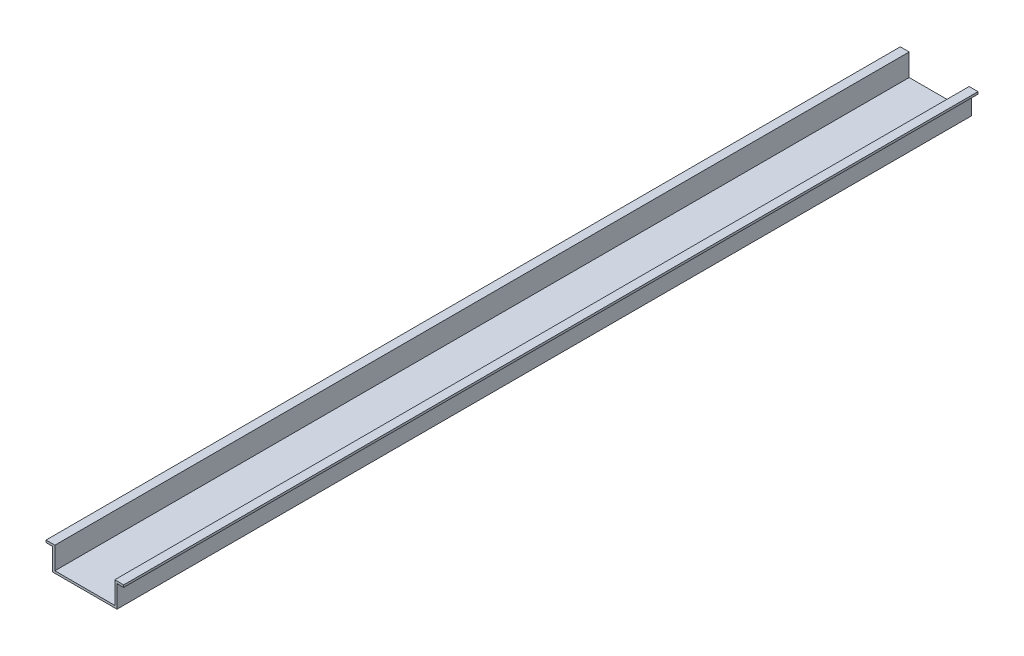
ISO-10303-21;
HEADER;
FILE_DESCRIPTION(('STEP AP214'),'2;1');
FILE_NAME('part.step','',(''),(''),'','','');
FILE_SCHEMA(('AUTOMOTIVE_DESIGN { 1 0 10303 214 1 1 1 1 }'));
ENDSEC;
DATA;
#1=APPLICATION_CONTEXT('core data for automotive mechanical design processes');
#2=APPLICATION_PROTOCOL_DEFINITION('international standard','automotive_design',2000,#1);
#3=PRODUCT_CONTEXT('',#1,'mechanical');
#4=PRODUCT('Part','Part','',(#3));
#5=PRODUCT_RELATED_PRODUCT_CATEGORY('part','',(#4));
#6=PRODUCT_DEFINITION_FORMATION('','',#4);
#7=PRODUCT_DEFINITION_CONTEXT('part definition',#1,'design');
#8=PRODUCT_DEFINITION('design','',#6,#7);
#9=PRODUCT_DEFINITION_SHAPE('','',#8);
#10=(LENGTH_UNIT() NAMED_UNIT(*) SI_UNIT(.MILLI.,.METRE.));
#11=(NAMED_UNIT(*) PLANE_ANGLE_UNIT() SI_UNIT($,.RADIAN.));
#12=(NAMED_UNIT(*) SI_UNIT($,.STERADIAN.) SOLID_ANGLE_UNIT());
#13=UNCERTAINTY_MEASURE_WITH_UNIT(LENGTH_MEASURE(1.E-05),#10,'distance_accuracy_value','');
#14=(GEOMETRIC_REPRESENTATION_CONTEXT(3) GLOBAL_UNCERTAINTY_ASSIGNED_CONTEXT((#13)) GLOBAL_UNIT_ASSIGNED_CONTEXT((#10,
#11,#12)) REPRESENTATION_CONTEXT('',''));
#15=CARTESIAN_POINT('',(0.,0.,0.));
#16=DIRECTION('',(0.,0.,1.));
#17=DIRECTION('',(1.,0.,0.));
#18=AXIS2_PLACEMENT_3D('',#15,#16,#17);
#19=CARTESIAN_POINT('',(-17.5,10.,385.));
#20=DIRECTION('',(1.,0.,0.));
#21=DIRECTION('',(0.,0.,-1.));
#22=AXIS2_PLACEMENT_3D('',#19,#20,#21);
#23=PLANE('',#22);
#24=DIRECTION('',(0.,-1.,0.));
#25=VECTOR('',#24,1.);
#26=CARTESIAN_POINT('',(-17.5,10.,0.));
#27=LINE('',#26,#25);
#28=CARTESIAN_POINT('',(-17.5,10.,0.));
#29=VERTEX_POINT('',#28);
#30=CARTESIAN_POINT('',(-17.5,9.,0.));
#31=VERTEX_POINT('',#30);
#32=EDGE_CURVE('E164',#29,#31,#27,.T.);
#33=ORIENTED_EDGE('',*,*,#32,.T.);
#34=DIRECTION('',(0.,0.,-1.));
#35=VECTOR('',#34,1.);
#36=CARTESIAN_POINT('',(-17.5,9.,385.));
#37=LINE('',#36,#35);
#38=CARTESIAN_POINT('',(-17.5,9.,385.));
#39=VERTEX_POINT('',#38);
#40=EDGE_CURVE('E11',#39,#31,#37,.T.);
#41=ORIENTED_EDGE('',*,*,#40,.F.);
#42=DIRECTION('',(0.,-1.,0.));
#43=VECTOR('',#42,1.);
#44=CARTESIAN_POINT('',(-17.5,10.,385.));
#45=LINE('',#44,#43);
#46=CARTESIAN_POINT('',(-17.5,10.,385.));
#47=VERTEX_POINT('',#46);
#48=EDGE_CURVE('E198',#47,#39,#45,.T.);
#49=ORIENTED_EDGE('',*,*,#48,.F.);
#50=DIRECTION('',(0.,0.,-1.));
#51=VECTOR('',#50,1.);
#52=CARTESIAN_POINT('',(-17.5,10.,385.));
#53=LINE('',#52,#51);
#54=EDGE_CURVE('E160',#47,#29,#53,.T.);
#55=ORIENTED_EDGE('',*,*,#54,.T.);
#56=EDGE_LOOP('',(#33,#41,#49,#55));
#57=FACE_BOUND('',#56,.T.);
#58=ADVANCED_FACE('F39',(#57),#23,.F.);
#59=CARTESIAN_POINT('',(-17.5,9.,385.));
#60=DIRECTION('',(0.,1.,0.));
#61=DIRECTION('',(0.,0.,1.));
#62=AXIS2_PLACEMENT_3D('',#59,#60,#61);
#63=PLANE('',#62);
#64=DIRECTION('',(1.,0.,0.));
#65=VECTOR('',#64,1.);
#66=CARTESIAN_POINT('',(-17.5,9.,0.));
#67=LINE('',#66,#65);
#68=CARTESIAN_POINT('',(-14.5,9.,0.));
#69=VERTEX_POINT('',#68);
#70=EDGE_CURVE('E168',#31,#69,#67,.T.);
#71=ORIENTED_EDGE('',*,*,#70,.T.);
#72=DIRECTION('',(0.,0.,-1.));
#73=VECTOR('',#72,1.);
#74=CARTESIAN_POINT('',(-14.5,9.,385.));
#75=LINE('',#74,#73);
#76=CARTESIAN_POINT('',(-14.5,9.,385.));
#77=VERTEX_POINT('',#76);
#78=EDGE_CURVE('E48',#77,#69,#75,.T.);
#79=ORIENTED_EDGE('',*,*,#78,.F.);
#80=DIRECTION('',(1.,0.,0.));
#81=VECTOR('',#80,1.);
#82=CARTESIAN_POINT('',(-17.5,9.,385.));
#83=LINE('',#82,#81);
#84=EDGE_CURVE('E111',#39,#77,#83,.T.);
#85=ORIENTED_EDGE('',*,*,#84,.F.);
#86=ORIENTED_EDGE('',*,*,#40,.T.);
#87=EDGE_LOOP('',(#71,#79,#85,#86));
#88=FACE_BOUND('',#87,.T.);
#89=ADVANCED_FACE('F292',(#88),#63,.F.);
#90=CARTESIAN_POINT('',(-14.5,9.,385.));
#91=DIRECTION('',(1.,0.,0.));
#92=DIRECTION('',(0.,1.,0.));
#93=AXIS2_PLACEMENT_3D('',#90,#91,#92);
#94=PLANE('',#93);
#95=DIRECTION('',(0.,-1.,0.));
#96=VECTOR('',#95,1.);
#97=CARTESIAN_POINT('',(-14.5,9.,0.));
#98=LINE('',#97,#96);
#99=CARTESIAN_POINT('',(-14.5,-1.,0.));
#100=VERTEX_POINT('',#99);
#101=EDGE_CURVE('E171',#69,#100,#98,.T.);
#102=ORIENTED_EDGE('',*,*,#101,.T.);
#103=DIRECTION('',(0.,0.,-1.));
#104=VECTOR('',#103,1.);
#105=CARTESIAN_POINT('',(-14.5,-1.,385.));
#106=LINE('',#105,#104);
#107=CARTESIAN_POINT('',(-14.5,-1.,385.));
#108=VERTEX_POINT('',#107);
#109=EDGE_CURVE('E225',#108,#100,#106,.T.);
#110=ORIENTED_EDGE('',*,*,#109,.F.);
#111=DIRECTION('',(0.,-1.,0.));
#112=VECTOR('',#111,1.);
#113=CARTESIAN_POINT('',(-14.5,9.,385.));
#114=LINE('',#113,#112);
#115=EDGE_CURVE('E235',#77,#108,#114,.T.);
#116=ORIENTED_EDGE('',*,*,#115,.F.);
#117=ORIENTED_EDGE('',*,*,#78,.T.);
#118=EDGE_LOOP('',(#102,#110,#116,#117));
#119=FACE_BOUND('',#118,.T.);
#120=ADVANCED_FACE('F233',(#119),#94,.F.);
#121=CARTESIAN_POINT('',(-14.5,-1.,385.));
#122=DIRECTION('',(0.,1.,0.));
#123=DIRECTION('',(0.,0.,1.));
#124=AXIS2_PLACEMENT_3D('',#121,#122,#123);
#125=PLANE('',#124);
#126=DIRECTION('',(1.,0.,0.));
#127=VECTOR('',#126,1.);
#128=CARTESIAN_POINT('',(-14.5,-1.,0.));
#129=LINE('',#128,#127);
#130=CARTESIAN_POINT('',(14.5,-1.,0.));
#131=VERTEX_POINT('',#130);
#132=EDGE_CURVE('E174',#100,#131,#129,.T.);
#133=ORIENTED_EDGE('',*,*,#132,.T.);
#134=DIRECTION('',(0.,0.,-1.));
#135=VECTOR('',#134,1.);
#136=CARTESIAN_POINT('',(14.5,-1.,385.));
#137=LINE('',#136,#135);
#138=CARTESIAN_POINT('',(14.5,-1.,385.));
#139=VERTEX_POINT('',#138);
#140=EDGE_CURVE('E221',#139,#131,#137,.T.);
#141=ORIENTED_EDGE('',*,*,#140,.F.);
#142=DIRECTION('',(1.,0.,0.));
#143=VECTOR('',#142,1.);
#144=CARTESIAN_POINT('',(-14.5,-1.,385.));
#145=LINE('',#144,#143);
#146=EDGE_CURVE('E254',#108,#139,#145,.T.);
#147=ORIENTED_EDGE('',*,*,#146,.F.);
#148=ORIENTED_EDGE('',*,*,#109,.T.);
#149=EDGE_LOOP('',(#133,#141,#147,#148));
#150=FACE_BOUND('',#149,.T.);
#151=ADVANCED_FACE('F244',(#150),#125,.F.);
#152=CARTESIAN_POINT('',(14.5,-1.,385.));
#153=DIRECTION('',(-1.,0.,0.));
#154=DIRECTION('',(0.,0.,1.));
#155=AXIS2_PLACEMENT_3D('',#152,#153,#154);
#156=PLANE('',#155);
#157=DIRECTION('',(0.,1.,0.));
#158=VECTOR('',#157,1.);
#159=CARTESIAN_POINT('',(14.5,-1.,0.));
#160=LINE('',#159,#158);
#161=CARTESIAN_POINT('',(14.5,9.,0.));
#162=VERTEX_POINT('',#161);
#163=EDGE_CURVE('E177',#131,#162,#160,.T.);
#164=ORIENTED_EDGE('',*,*,#163,.T.);
#165=DIRECTION('',(0.,0.,-1.));
#166=VECTOR('',#165,1.);
#167=CARTESIAN_POINT('',(14.5,9.,385.));
#168=LINE('',#167,#166);
#169=CARTESIAN_POINT('',(14.5,9.,385.));
#170=VERTEX_POINT('',#169);
#171=EDGE_CURVE('E217',#170,#162,#168,.T.);
#172=ORIENTED_EDGE('',*,*,#171,.F.);
#173=DIRECTION('',(0.,1.,0.));
#174=VECTOR('',#173,1.);
#175=CARTESIAN_POINT('',(14.5,-1.,385.));
#176=LINE('',#175,#174);
#177=EDGE_CURVE('E250',#139,#170,#176,.T.);
#178=ORIENTED_EDGE('',*,*,#177,.F.);
#179=ORIENTED_EDGE('',*,*,#140,.T.);
#180=EDGE_LOOP('',(#164,#172,#178,#179));
#181=FACE_BOUND('',#180,.T.);
#182=ADVANCED_FACE('F248',(#181),#156,.F.);
#183=CARTESIAN_POINT('',(14.5,9.,385.));
#184=DIRECTION('',(0.,1.,0.));
#185=DIRECTION('',(0.,0.,1.));
#186=AXIS2_PLACEMENT_3D('',#183,#184,#185);
#187=PLANE('',#186);
#188=DIRECTION('',(1.,0.,0.));
#189=VECTOR('',#188,1.);
#190=CARTESIAN_POINT('',(14.5,9.,0.));
#191=LINE('',#190,#189);
#192=CARTESIAN_POINT('',(17.5,9.,0.));
#193=VERTEX_POINT('',#192);
#194=EDGE_CURVE('E180',#162,#193,#191,.T.);
#195=ORIENTED_EDGE('',*,*,#194,.T.);
#196=DIRECTION('',(0.,0.,-1.));
#197=VECTOR('',#196,1.);
#198=CARTESIAN_POINT('',(17.5,9.,385.));
#199=LINE('',#198,#197);
#200=CARTESIAN_POINT('',(17.5,9.,385.));
#201=VERTEX_POINT('',#200);
#202=EDGE_CURVE('E213',#201,#193,#199,.T.);
#203=ORIENTED_EDGE('',*,*,#202,.F.);
#204=DIRECTION('',(1.,0.,0.));
#205=VECTOR('',#204,1.);
#206=CARTESIAN_POINT('',(14.5,9.,385.));
#207=LINE('',#206,#205);
#208=EDGE_CURVE('E253',#170,#201,#207,.T.);
#209=ORIENTED_EDGE('',*,*,#208,.F.);
#210=ORIENTED_EDGE('',*,*,#171,.T.);
#211=EDGE_LOOP('',(#195,#203,#209,#210));
#212=FACE_BOUND('',#211,.T.);
#213=ADVANCED_FACE('F305',(#212),#187,.F.);
#214=CARTESIAN_POINT('',(17.5,10.,385.));
#215=DIRECTION('',(-1.,0.,0.));
#216=DIRECTION('',(0.,0.,1.));
#217=AXIS2_PLACEMENT_3D('',#214,#215,#216);
#218=PLANE('',#217);
#219=DIRECTION('',(0.,1.,0.));
#220=VECTOR('',#219,1.);
#221=CARTESIAN_POINT('',(17.5,10.,0.));
#222=LINE('',#221,#220);
#223=CARTESIAN_POINT('',(17.5,10.,0.));
#224=VERTEX_POINT('',#223);
#225=EDGE_CURVE('E183',#193,#224,#222,.T.);
#226=ORIENTED_EDGE('',*,*,#225,.T.);
#227=DIRECTION('',(0.,0.,-1.));
#228=VECTOR('',#227,1.);
#229=CARTESIAN_POINT('',(17.5,10.,385.));
#230=LINE('',#229,#228);
#231=CARTESIAN_POINT('',(17.5,10.,385.));
#232=VERTEX_POINT('',#231);
#233=EDGE_CURVE('E209',#232,#224,#230,.T.);
#234=ORIENTED_EDGE('',*,*,#233,.F.);
#235=DIRECTION('',(0.,1.,0.));
#236=VECTOR('',#235,1.);
#237=CARTESIAN_POINT('',(17.5,10.,385.));
#238=LINE('',#237,#236);
#239=EDGE_CURVE('E258',#201,#232,#238,.T.);
#240=ORIENTED_EDGE('',*,*,#239,.F.);
#241=ORIENTED_EDGE('',*,*,#202,.T.);
#242=EDGE_LOOP('',(#226,#234,#240,#241));
#243=FACE_BOUND('',#242,.T.);
#244=ADVANCED_FACE('F308',(#243),#218,.F.);
#245=CARTESIAN_POINT('',(13.5,10.,385.));
#246=DIRECTION('',(0.,-1.,0.));
#247=DIRECTION('',(1.,0.,0.));
#248=AXIS2_PLACEMENT_3D('',#245,#246,#247);
#249=PLANE('',#248);
#250=DIRECTION('',(-1.,0.,0.));
#251=VECTOR('',#250,1.);
#252=CARTESIAN_POINT('',(13.5,10.,0.));
#253=LINE('',#252,#251);
#254=CARTESIAN_POINT('',(13.5,10.,0.));
#255=VERTEX_POINT('',#254);
#256=EDGE_CURVE('E186',#224,#255,#253,.T.);
#257=ORIENTED_EDGE('',*,*,#256,.T.);
#258=DIRECTION('',(0.,0.,-1.));
#259=VECTOR('',#258,1.);
#260=CARTESIAN_POINT('',(13.5,10.,385.));
#261=LINE('',#260,#259);
#262=CARTESIAN_POINT('',(13.5,10.,385.));
#263=VERTEX_POINT('',#262);
#264=EDGE_CURVE('E205',#263,#255,#261,.T.);
#265=ORIENTED_EDGE('',*,*,#264,.F.);
#266=DIRECTION('',(-1.,0.,0.));
#267=VECTOR('',#266,1.);
#268=CARTESIAN_POINT('',(13.5,10.,385.));
#269=LINE('',#268,#267);
#270=EDGE_CURVE('E265',#232,#263,#269,.T.);
#271=ORIENTED_EDGE('',*,*,#270,.F.);
#272=ORIENTED_EDGE('',*,*,#233,.T.);
#273=EDGE_LOOP('',(#257,#265,#271,#272));
#274=FACE_BOUND('',#273,.T.);
#275=ADVANCED_FACE('F273',(#274),#249,.F.);
#276=CARTESIAN_POINT('',(13.5,0.,385.));
#277=DIRECTION('',(1.,0.,0.));
#278=DIRECTION('',(0.,1.,0.));
#279=AXIS2_PLACEMENT_3D('',#276,#277,#278);
#280=PLANE('',#279);
#281=DIRECTION('',(0.,-1.,0.));
#282=VECTOR('',#281,1.);
#283=CARTESIAN_POINT('',(13.5,0.,0.));
#284=LINE('',#283,#282);
#285=CARTESIAN_POINT('',(13.5,0.,0.));
#286=VERTEX_POINT('',#285);
#287=EDGE_CURVE('E189',#255,#286,#284,.T.);
#288=ORIENTED_EDGE('',*,*,#287,.T.);
#289=DIRECTION('',(0.,0.,-1.));
#290=VECTOR('',#289,1.);
#291=CARTESIAN_POINT('',(13.5,0.,385.));
#292=LINE('',#291,#290);
#293=CARTESIAN_POINT('',(13.5,0.,385.));
#294=VERTEX_POINT('',#293);
#295=EDGE_CURVE('E153',#294,#286,#292,.T.);
#296=ORIENTED_EDGE('',*,*,#295,.F.);
#297=DIRECTION('',(0.,-1.,0.));
#298=VECTOR('',#297,1.);
#299=CARTESIAN_POINT('',(13.5,0.,385.));
#300=LINE('',#299,#298);
#301=EDGE_CURVE('E142',#263,#294,#300,.T.);
#302=ORIENTED_EDGE('',*,*,#301,.F.);
#303=ORIENTED_EDGE('',*,*,#264,.T.);
#304=EDGE_LOOP('',(#288,#296,#302,#303));
#305=FACE_BOUND('',#304,.T.);
#306=ADVANCED_FACE('F277',(#305),#280,.F.);
#307=CARTESIAN_POINT('',(-13.5,0.,385.));
#308=DIRECTION('',(0.,-1.,0.));
#309=DIRECTION('',(1.,0.,0.));
#310=AXIS2_PLACEMENT_3D('',#307,#308,#309);
#311=PLANE('',#310);
#312=DIRECTION('',(-1.,0.,0.));
#313=VECTOR('',#312,1.);
#314=CARTESIAN_POINT('',(-13.5,0.,0.));
#315=LINE('',#314,#313);
#316=CARTESIAN_POINT('',(-13.5,0.,0.));
#317=VERTEX_POINT('',#316);
#318=EDGE_CURVE('E151',#286,#317,#315,.T.);
#319=ORIENTED_EDGE('',*,*,#318,.T.);
#320=DIRECTION('',(0.,0.,-1.));
#321=VECTOR('',#320,1.);
#322=CARTESIAN_POINT('',(-13.5,0.,385.));
#323=LINE('',#322,#321);
#324=CARTESIAN_POINT('',(-13.5,0.,385.));
#325=VERTEX_POINT('',#324);
#326=EDGE_CURVE('E148',#325,#317,#323,.T.);
#327=ORIENTED_EDGE('',*,*,#326,.F.);
#328=DIRECTION('',(-1.,0.,0.));
#329=VECTOR('',#328,1.);
#330=CARTESIAN_POINT('',(-13.5,0.,385.));
#331=LINE('',#330,#329);
#332=EDGE_CURVE('E136',#294,#325,#331,.T.);
#333=ORIENTED_EDGE('',*,*,#332,.F.);
#334=ORIENTED_EDGE('',*,*,#295,.T.);
#335=EDGE_LOOP('',(#319,#327,#333,#334));
#336=FACE_BOUND('',#335,.T.);
#337=ADVANCED_FACE('F149',(#336),#311,.F.);
#338=CARTESIAN_POINT('',(-13.5,10.,385.));
#339=DIRECTION('',(-1.,0.,0.));
#340=DIRECTION('',(0.,-1.,0.));
#341=AXIS2_PLACEMENT_3D('',#338,#339,#340);
#342=PLANE('',#341);
#343=DIRECTION('',(0.,1.,0.));
#344=VECTOR('',#343,1.);
#345=CARTESIAN_POINT('',(-13.5,10.,0.));
#346=LINE('',#345,#344);
#347=CARTESIAN_POINT('',(-13.5,10.,0.));
#348=VERTEX_POINT('',#347);
#349=EDGE_CURVE('E97',#317,#348,#346,.T.);
#350=ORIENTED_EDGE('',*,*,#349,.T.);
#351=DIRECTION('',(0.,0.,-1.));
#352=VECTOR('',#351,1.);
#353=CARTESIAN_POINT('',(-13.5,10.,385.));
#354=LINE('',#353,#352);
#355=CARTESIAN_POINT('',(-13.5,10.,385.));
#356=VERTEX_POINT('',#355);
#357=EDGE_CURVE('E154',#356,#348,#354,.T.);
#358=ORIENTED_EDGE('',*,*,#357,.F.);
#359=DIRECTION('',(0.,1.,0.));
#360=VECTOR('',#359,1.);
#361=CARTESIAN_POINT('',(-13.5,10.,385.));
#362=LINE('',#361,#360);
#363=EDGE_CURVE('E140',#325,#356,#362,.T.);
#364=ORIENTED_EDGE('',*,*,#363,.F.);
#365=ORIENTED_EDGE('',*,*,#326,.T.);
#366=EDGE_LOOP('',(#350,#358,#364,#365));
#367=FACE_BOUND('',#366,.T.);
#368=ADVANCED_FACE('F156',(#367),#342,.F.);
#369=CARTESIAN_POINT('',(-17.5,10.,385.));
#370=DIRECTION('',(0.,-1.,0.));
#371=DIRECTION('',(0.,0.,-1.));
#372=AXIS2_PLACEMENT_3D('',#369,#370,#371);
#373=PLANE('',#372);
#374=DIRECTION('',(-1.,0.,0.));
#375=VECTOR('',#374,1.);
#376=CARTESIAN_POINT('',(-17.5,10.,0.));
#377=LINE('',#376,#375);
#378=EDGE_CURVE('E103',#348,#29,#377,.T.);
#379=ORIENTED_EDGE('',*,*,#378,.T.);
#380=ORIENTED_EDGE('',*,*,#54,.F.);
#381=DIRECTION('',(-1.,0.,0.));
#382=VECTOR('',#381,1.);
#383=CARTESIAN_POINT('',(-17.5,10.,385.));
#384=LINE('',#383,#382);
#385=EDGE_CURVE('E56',#356,#47,#384,.T.);
#386=ORIENTED_EDGE('',*,*,#385,.F.);
#387=ORIENTED_EDGE('',*,*,#357,.T.);
#388=EDGE_LOOP('',(#379,#380,#386,#387));
#389=FACE_BOUND('',#388,.T.);
#390=ADVANCED_FACE('F281',(#389),#373,.F.);
#391=CARTESIAN_POINT('',(0.,0.,385.));
#392=DIRECTION('',(0.,0.,1.));
#393=DIRECTION('',(1.,0.,0.));
#394=AXIS2_PLACEMENT_3D('',#391,#392,#393);
#395=PLANE('',#394);
#396=ORIENTED_EDGE('',*,*,#48,.T.);
#397=ORIENTED_EDGE('',*,*,#84,.T.);
#398=ORIENTED_EDGE('',*,*,#115,.T.);
#399=ORIENTED_EDGE('',*,*,#146,.T.);
#400=ORIENTED_EDGE('',*,*,#177,.T.);
#401=ORIENTED_EDGE('',*,*,#208,.T.);
#402=ORIENTED_EDGE('',*,*,#239,.T.);
#403=ORIENTED_EDGE('',*,*,#270,.T.);
#404=ORIENTED_EDGE('',*,*,#301,.T.);
#405=ORIENTED_EDGE('',*,*,#332,.T.);
#406=ORIENTED_EDGE('',*,*,#363,.T.);
#407=ORIENTED_EDGE('',*,*,#385,.T.);
#408=EDGE_LOOP('',(#396,#397,#398,#399,#400,#401,#402,#403,#404,#405,#406,#407));
#409=FACE_BOUND('',#408,.T.);
#410=ADVANCED_FACE('F138',(#409),#395,.T.);
#411=CARTESIAN_POINT('',(0.,0.,0.));
#412=DIRECTION('',(0.,0.,1.));
#413=DIRECTION('',(1.,0.,0.));
#414=AXIS2_PLACEMENT_3D('',#411,#412,#413);
#415=PLANE('',#414);
#416=ORIENTED_EDGE('',*,*,#32,.F.);
#417=ORIENTED_EDGE('',*,*,#378,.F.);
#418=ORIENTED_EDGE('',*,*,#349,.F.);
#419=ORIENTED_EDGE('',*,*,#318,.F.);
#420=ORIENTED_EDGE('',*,*,#287,.F.);
#421=ORIENTED_EDGE('',*,*,#256,.F.);
#422=ORIENTED_EDGE('',*,*,#225,.F.);
#423=ORIENTED_EDGE('',*,*,#194,.F.);
#424=ORIENTED_EDGE('',*,*,#163,.F.);
#425=ORIENTED_EDGE('',*,*,#132,.F.);
#426=ORIENTED_EDGE('',*,*,#101,.F.);
#427=ORIENTED_EDGE('',*,*,#70,.F.);
#428=EDGE_LOOP('',(#416,#417,#418,#419,#420,#421,#422,#423,#424,#425,#426,#427));
#429=FACE_BOUND('',#428,.T.);
#430=ADVANCED_FACE('F239',(#429),#415,.F.);
#431=CLOSED_SHELL('',(#58,#89,#120,#151,#182,#213,#244,#275,#306,#337,#368,#390,#410,#430));
#432=MANIFOLD_SOLID_BREP('B2',#431);
#433=ADVANCED_BREP_SHAPE_REPRESENTATION('',(#18,#432),#14);
#434=SHAPE_DEFINITION_REPRESENTATION(#9,#433);
ENDSEC;
END-ISO-10303-21;
